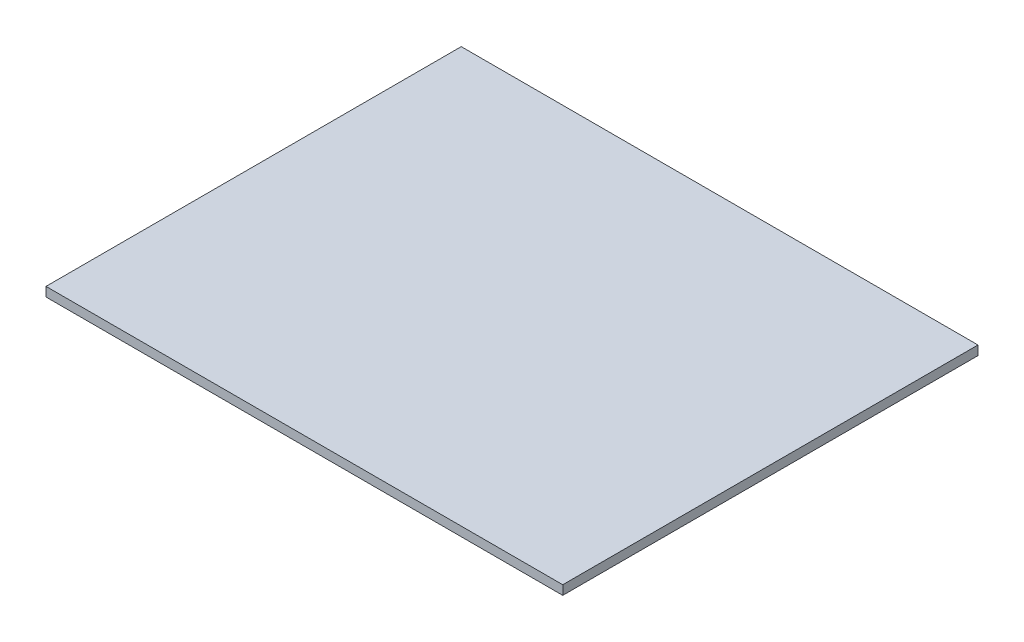
ISO-10303-21;
HEADER;
FILE_DESCRIPTION(('STEP AP214'),'2;1');
FILE_NAME('part.step','',(''),(''),'','','');
FILE_SCHEMA(('AUTOMOTIVE_DESIGN { 1 0 10303 214 1 1 1 1 }'));
ENDSEC;
DATA;
#1=APPLICATION_CONTEXT('core data for automotive mechanical design processes');
#2=APPLICATION_PROTOCOL_DEFINITION('international standard','automotive_design',2000,#1);
#3=PRODUCT_CONTEXT('',#1,'mechanical');
#4=PRODUCT('Part','Part','',(#3));
#5=PRODUCT_RELATED_PRODUCT_CATEGORY('part','',(#4));
#6=PRODUCT_DEFINITION_FORMATION('','',#4);
#7=PRODUCT_DEFINITION_CONTEXT('part definition',#1,'design');
#8=PRODUCT_DEFINITION('design','',#6,#7);
#9=PRODUCT_DEFINITION_SHAPE('','',#8);
#10=(LENGTH_UNIT() NAMED_UNIT(*) SI_UNIT(.MILLI.,.METRE.));
#11=(NAMED_UNIT(*) PLANE_ANGLE_UNIT() SI_UNIT($,.RADIAN.));
#12=(NAMED_UNIT(*) SI_UNIT($,.STERADIAN.) SOLID_ANGLE_UNIT());
#13=UNCERTAINTY_MEASURE_WITH_UNIT(LENGTH_MEASURE(1.E-05),#10,'distance_accuracy_value','');
#14=(GEOMETRIC_REPRESENTATION_CONTEXT(3) GLOBAL_UNCERTAINTY_ASSIGNED_CONTEXT((#13)) GLOBAL_UNIT_ASSIGNED_CONTEXT((#10,
#11,#12)) REPRESENTATION_CONTEXT('',''));
#15=CARTESIAN_POINT('',(0.,0.,0.));
#16=DIRECTION('',(0.,0.,1.));
#17=DIRECTION('',(1.,0.,0.));
#18=AXIS2_PLACEMENT_3D('',#15,#16,#17);
#19=CARTESIAN_POINT('',(28.,1.,-22.5));
#20=DIRECTION('',(-1.,0.,0.));
#21=DIRECTION('',(0.,0.,1.));
#22=AXIS2_PLACEMENT_3D('',#19,#20,#21);
#23=PLANE('',#22);
#24=DIRECTION('',(0.,0.,-1.));
#25=VECTOR('',#24,1.);
#26=CARTESIAN_POINT('',(28.,0.,-22.5));
#27=LINE('',#26,#25);
#28=CARTESIAN_POINT('',(28.,0.,22.5));
#29=VERTEX_POINT('',#28);
#30=CARTESIAN_POINT('',(28.,0.,-22.5));
#31=VERTEX_POINT('',#30);
#32=EDGE_CURVE('E96',#29,#31,#27,.T.);
#33=ORIENTED_EDGE('',*,*,#32,.T.);
#34=DIRECTION('',(0.,-1.,0.));
#35=VECTOR('',#34,1.);
#36=CARTESIAN_POINT('',(28.,1.,-22.5));
#37=LINE('',#36,#35);
#38=CARTESIAN_POINT('',(28.,1.,-22.5));
#39=VERTEX_POINT('',#38);
#40=EDGE_CURVE('E11',#39,#31,#37,.T.);
#41=ORIENTED_EDGE('',*,*,#40,.F.);
#42=DIRECTION('',(0.,0.,-1.));
#43=VECTOR('',#42,1.);
#44=CARTESIAN_POINT('',(28.,1.,-22.5));
#45=LINE('',#44,#43);
#46=CARTESIAN_POINT('',(28.,1.,22.5));
#47=VERTEX_POINT('',#46);
#48=EDGE_CURVE('E84',#47,#39,#45,.T.);
#49=ORIENTED_EDGE('',*,*,#48,.F.);
#50=DIRECTION('',(0.,-1.,0.));
#51=VECTOR('',#50,1.);
#52=CARTESIAN_POINT('',(28.,1.,22.5));
#53=LINE('',#52,#51);
#54=EDGE_CURVE('E92',#47,#29,#53,.T.);
#55=ORIENTED_EDGE('',*,*,#54,.T.);
#56=EDGE_LOOP('',(#33,#41,#49,#55));
#57=FACE_BOUND('',#56,.T.);
#58=ADVANCED_FACE('F33',(#57),#23,.F.);
#59=CARTESIAN_POINT('',(-28.,1.,-22.5));
#60=DIRECTION('',(0.,0.,1.));
#61=DIRECTION('',(1.,0.,0.));
#62=AXIS2_PLACEMENT_3D('',#59,#60,#61);
#63=PLANE('',#62);
#64=DIRECTION('',(-1.,0.,0.));
#65=VECTOR('',#64,1.);
#66=CARTESIAN_POINT('',(-28.,0.,-22.5));
#67=LINE('',#66,#65);
#68=CARTESIAN_POINT('',(-28.,0.,-22.5));
#69=VERTEX_POINT('',#68);
#70=EDGE_CURVE('E88',#31,#69,#67,.T.);
#71=ORIENTED_EDGE('',*,*,#70,.T.);
#72=DIRECTION('',(0.,-1.,0.));
#73=VECTOR('',#72,1.);
#74=CARTESIAN_POINT('',(-28.,1.,-22.5));
#75=LINE('',#74,#73);
#76=CARTESIAN_POINT('',(-28.,1.,-22.5));
#77=VERTEX_POINT('',#76);
#78=EDGE_CURVE('E41',#77,#69,#75,.T.);
#79=ORIENTED_EDGE('',*,*,#78,.F.);
#80=DIRECTION('',(-1.,0.,0.));
#81=VECTOR('',#80,1.);
#82=CARTESIAN_POINT('',(-28.,1.,-22.5));
#83=LINE('',#82,#81);
#84=EDGE_CURVE('E79',#39,#77,#83,.T.);
#85=ORIENTED_EDGE('',*,*,#84,.F.);
#86=ORIENTED_EDGE('',*,*,#40,.T.);
#87=EDGE_LOOP('',(#71,#79,#85,#86));
#88=FACE_BOUND('',#87,.T.);
#89=ADVANCED_FACE('F87',(#88),#63,.F.);
#90=CARTESIAN_POINT('',(-28.,1.,-22.5));
#91=DIRECTION('',(1.,0.,0.));
#92=DIRECTION('',(0.,0.,-1.));
#93=AXIS2_PLACEMENT_3D('',#90,#91,#92);
#94=PLANE('',#93);
#95=DIRECTION('',(0.,0.,1.));
#96=VECTOR('',#95,1.);
#97=CARTESIAN_POINT('',(-28.,0.,-22.5));
#98=LINE('',#97,#96);
#99=CARTESIAN_POINT('',(-28.,0.,22.5));
#100=VERTEX_POINT('',#99);
#101=EDGE_CURVE('E66',#69,#100,#98,.T.);
#102=ORIENTED_EDGE('',*,*,#101,.T.);
#103=DIRECTION('',(0.,-1.,0.));
#104=VECTOR('',#103,1.);
#105=CARTESIAN_POINT('',(-28.,1.,22.5));
#106=LINE('',#105,#104);
#107=CARTESIAN_POINT('',(-28.,1.,22.5));
#108=VERTEX_POINT('',#107);
#109=EDGE_CURVE('E89',#108,#100,#106,.T.);
#110=ORIENTED_EDGE('',*,*,#109,.F.);
#111=DIRECTION('',(0.,0.,1.));
#112=VECTOR('',#111,1.);
#113=CARTESIAN_POINT('',(-28.,1.,-22.5));
#114=LINE('',#113,#112);
#115=EDGE_CURVE('E82',#77,#108,#114,.T.);
#116=ORIENTED_EDGE('',*,*,#115,.F.);
#117=ORIENTED_EDGE('',*,*,#78,.T.);
#118=EDGE_LOOP('',(#102,#110,#116,#117));
#119=FACE_BOUND('',#118,.T.);
#120=ADVANCED_FACE('F90',(#119),#94,.F.);
#121=CARTESIAN_POINT('',(-28.,1.,22.5));
#122=DIRECTION('',(0.,0.,-1.));
#123=DIRECTION('',(-1.,0.,0.));
#124=AXIS2_PLACEMENT_3D('',#121,#122,#123);
#125=PLANE('',#124);
#126=DIRECTION('',(1.,0.,0.));
#127=VECTOR('',#126,1.);
#128=CARTESIAN_POINT('',(-28.,0.,22.5));
#129=LINE('',#128,#127);
#130=EDGE_CURVE('E72',#100,#29,#129,.T.);
#131=ORIENTED_EDGE('',*,*,#130,.T.);
#132=ORIENTED_EDGE('',*,*,#54,.F.);
#133=DIRECTION('',(1.,0.,0.));
#134=VECTOR('',#133,1.);
#135=CARTESIAN_POINT('',(-28.,1.,22.5));
#136=LINE('',#135,#134);
#137=EDGE_CURVE('E49',#108,#47,#136,.T.);
#138=ORIENTED_EDGE('',*,*,#137,.F.);
#139=ORIENTED_EDGE('',*,*,#109,.T.);
#140=EDGE_LOOP('',(#131,#132,#138,#139));
#141=FACE_BOUND('',#140,.T.);
#142=ADVANCED_FACE('F103',(#141),#125,.F.);
#143=CARTESIAN_POINT('',(0.,1.,0.));
#144=DIRECTION('',(0.,1.,0.));
#145=DIRECTION('',(0.,0.,1.));
#146=AXIS2_PLACEMENT_3D('',#143,#144,#145);
#147=PLANE('',#146);
#148=ORIENTED_EDGE('',*,*,#48,.T.);
#149=ORIENTED_EDGE('',*,*,#84,.T.);
#150=ORIENTED_EDGE('',*,*,#115,.T.);
#151=ORIENTED_EDGE('',*,*,#137,.T.);
#152=EDGE_LOOP('',(#148,#149,#150,#151));
#153=FACE_BOUND('',#152,.T.);
#154=ADVANCED_FACE('F80',(#153),#147,.T.);
#155=CARTESIAN_POINT('',(0.,0.,0.));
#156=DIRECTION('',(0.,1.,0.));
#157=DIRECTION('',(0.,0.,1.));
#158=AXIS2_PLACEMENT_3D('',#155,#156,#157);
#159=PLANE('',#158);
#160=ORIENTED_EDGE('',*,*,#32,.F.);
#161=ORIENTED_EDGE('',*,*,#130,.F.);
#162=ORIENTED_EDGE('',*,*,#101,.F.);
#163=ORIENTED_EDGE('',*,*,#70,.F.);
#164=EDGE_LOOP('',(#160,#161,#162,#163));
#165=FACE_BOUND('',#164,.T.);
#166=ADVANCED_FACE('F106',(#165),#159,.F.);
#167=CLOSED_SHELL('',(#58,#89,#120,#142,#154,#166));
#168=MANIFOLD_SOLID_BREP('B2',#167);
#169=ADVANCED_BREP_SHAPE_REPRESENTATION('',(#18,#168),#14);
#170=SHAPE_DEFINITION_REPRESENTATION(#9,#169);
ENDSEC;
END-ISO-10303-21;
